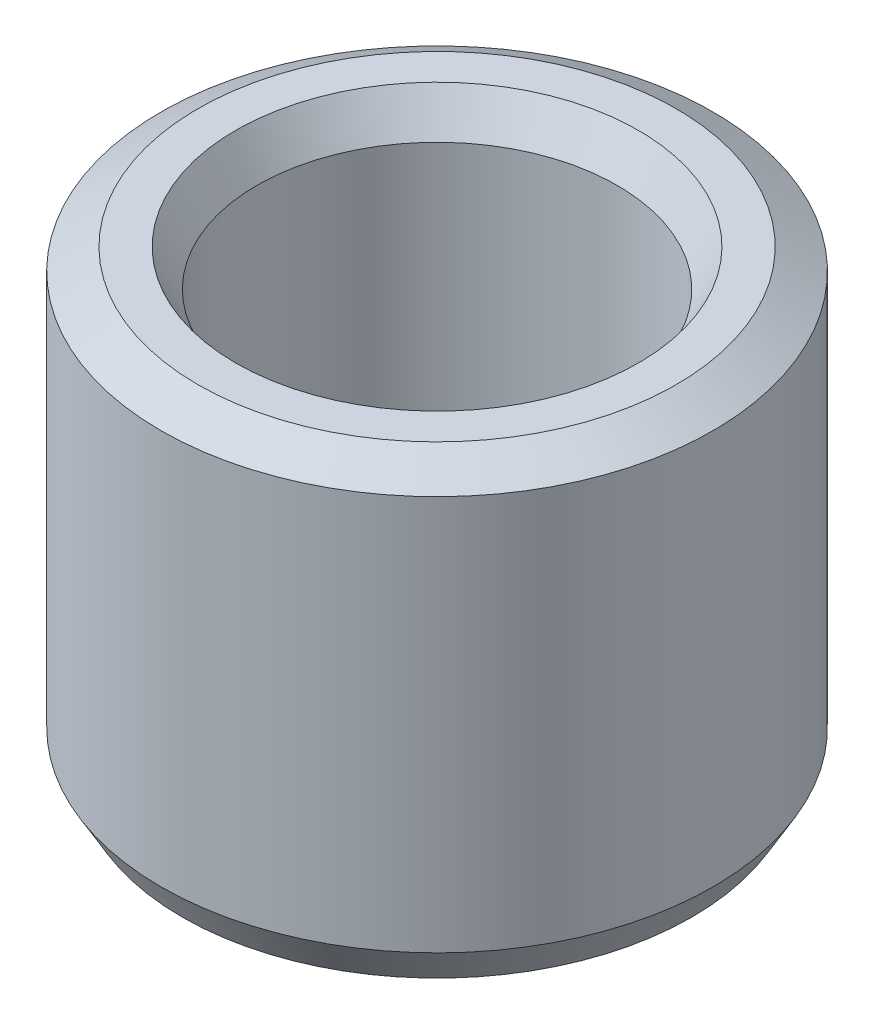
ISO-10303-21;
HEADER;
FILE_DESCRIPTION(('STEP AP214'),'2;1');
FILE_NAME('part.step','',(''),(''),'','','');
FILE_SCHEMA(('AUTOMOTIVE_DESIGN { 1 0 10303 214 1 1 1 1 }'));
ENDSEC;
DATA;
#1=APPLICATION_CONTEXT('core data for automotive mechanical design processes');
#2=APPLICATION_PROTOCOL_DEFINITION('international standard','automotive_design',2000,#1);
#3=PRODUCT_CONTEXT('',#1,'mechanical');
#4=PRODUCT('Part','Part','',(#3));
#5=PRODUCT_RELATED_PRODUCT_CATEGORY('part','',(#4));
#6=PRODUCT_DEFINITION_FORMATION('','',#4);
#7=PRODUCT_DEFINITION_CONTEXT('part definition',#1,'design');
#8=PRODUCT_DEFINITION('design','',#6,#7);
#9=PRODUCT_DEFINITION_SHAPE('','',#8);
#10=(LENGTH_UNIT() NAMED_UNIT(*) SI_UNIT(.MILLI.,.METRE.));
#11=(NAMED_UNIT(*) PLANE_ANGLE_UNIT() SI_UNIT($,.RADIAN.));
#12=(NAMED_UNIT(*) SI_UNIT($,.STERADIAN.) SOLID_ANGLE_UNIT());
#13=UNCERTAINTY_MEASURE_WITH_UNIT(LENGTH_MEASURE(1.E-05),#10,'distance_accuracy_value','');
#14=(GEOMETRIC_REPRESENTATION_CONTEXT(3) GLOBAL_UNCERTAINTY_ASSIGNED_CONTEXT((#13)) GLOBAL_UNIT_ASSIGNED_CONTEXT((#10,
#11,#12)) REPRESENTATION_CONTEXT('',''));
#15=CARTESIAN_POINT('',(0.,0.,0.));
#16=DIRECTION('',(0.,0.,1.));
#17=DIRECTION('',(1.,0.,0.));
#18=AXIS2_PLACEMENT_3D('',#15,#16,#17);
#19=CARTESIAN_POINT('',(0.,78.0125997931083,0.));
#20=DIRECTION('',(0.,-1.,0.));
#21=DIRECTION('',(0.,0.,-1.));
#22=AXIS2_PLACEMENT_3D('',#19,#20,#21);
#23=CYLINDRICAL_SURFACE('',#22,47.5);
#24=CARTESIAN_POINT('',(0.,6.35694811620943,0.));
#25=DIRECTION('',(0.,1.,0.));
#26=DIRECTION('',(0.,0.,1.));
#27=AXIS2_PLACEMENT_3D('',#24,#25,#26);
#28=CIRCLE('',#27,47.5);
#29=CARTESIAN_POINT('',(0.,6.35694811620943,47.5));
#30=VERTEX_POINT('',#29);
#31=EDGE_CURVE('E10',#30,#30,#28,.T.);
#32=ORIENTED_EDGE('',*,*,#31,.T.);
#33=EDGE_LOOP('',(#32));
#34=FACE_BOUND('',#33,.T.);
#35=CARTESIAN_POINT('',(0.,74.3424140869902,0.));
#36=DIRECTION('',(0.,1.,0.));
#37=DIRECTION('',(0.,0.,1.));
#38=AXIS2_PLACEMENT_3D('',#35,#36,#37);
#39=CIRCLE('',#38,47.5);
#40=CARTESIAN_POINT('',(0.,74.3424140869902,47.5));
#41=VERTEX_POINT('',#40);
#42=EDGE_CURVE('E50',#41,#41,#39,.F.);
#43=ORIENTED_EDGE('',*,*,#42,.T.);
#44=EDGE_LOOP('',(#43));
#45=FACE_BOUND('',#44,.T.);
#46=ADVANCED_FACE('F39',(#34,#45),#23,.T.);
#47=CARTESIAN_POINT('',(0.,78.0125997931083,0.));
#48=DIRECTION('',(0.,1.,0.));
#49=DIRECTION('',(0.,0.,1.));
#50=AXIS2_PLACEMENT_3D('',#47,#48,#49);
#51=PLANE('',#50);
#52=CARTESIAN_POINT('',(0.,78.0125997931083,0.));
#53=DIRECTION('',(0.,1.,0.));
#54=DIRECTION('',(0.,0.,1.));
#55=AXIS2_PLACEMENT_3D('',#52,#53,#54);
#56=CIRCLE('',#55,34.6663554390578);
#57=CARTESIAN_POINT('',(0.,78.0125997931083,34.6663554390578));
#58=VERTEX_POINT('',#57);
#59=EDGE_CURVE('E58',#58,#58,#56,.F.);
#60=ORIENTED_EDGE('',*,*,#59,.T.);
#61=EDGE_LOOP('',(#60));
#62=FACE_BOUND('',#61,.T.);
#63=CARTESIAN_POINT('',(0.,78.0125997931083,0.));
#64=DIRECTION('',(0.,1.,0.));
#65=DIRECTION('',(0.,0.,1.));
#66=AXIS2_PLACEMENT_3D('',#63,#64,#65);
#67=CIRCLE('',#66,41.1430518837905);
#68=CARTESIAN_POINT('',(0.,78.0125997931083,41.1430518837905));
#69=VERTEX_POINT('',#68);
#70=EDGE_CURVE('E61',#69,#69,#67,.T.);
#71=ORIENTED_EDGE('',*,*,#70,.T.);
#72=EDGE_LOOP('',(#71));
#73=FACE_BOUND('',#72,.T.);
#74=ADVANCED_FACE('F88',(#62,#73),#51,.T.);
#75=CARTESIAN_POINT('',(0.,0.,0.));
#76=DIRECTION('',(0.,1.,0.));
#77=DIRECTION('',(0.,0.,1.));
#78=AXIS2_PLACEMENT_3D('',#75,#76,#77);
#79=PLANE('',#78);
#80=CARTESIAN_POINT('',(0.,0.,0.));
#81=DIRECTION('',(0.,1.,0.));
#82=DIRECTION('',(0.,0.,1.));
#83=AXIS2_PLACEMENT_3D('',#80,#81,#82);
#84=CIRCLE('',#83,37.3531178491492);
#85=CARTESIAN_POINT('',(0.,0.,37.3531178491492));
#86=VERTEX_POINT('',#85);
#87=EDGE_CURVE('E51',#86,#86,#84,.T.);
#88=ORIENTED_EDGE('',*,*,#87,.T.);
#89=EDGE_LOOP('',(#88));
#90=FACE_BOUND('',#89,.T.);
#91=CARTESIAN_POINT('',(0.,0.,0.));
#92=DIRECTION('',(0.,1.,0.));
#93=DIRECTION('',(0.,0.,1.));
#94=AXIS2_PLACEMENT_3D('',#91,#92,#93);
#95=CIRCLE('',#94,43.829814293882);
#96=CARTESIAN_POINT('',(0.,0.,43.829814293882));
#97=VERTEX_POINT('',#96);
#98=EDGE_CURVE('E54',#97,#97,#95,.F.);
#99=ORIENTED_EDGE('',*,*,#98,.T.);
#100=EDGE_LOOP('',(#99));
#101=FACE_BOUND('',#100,.T.);
#102=ADVANCED_FACE('F83',(#90,#101),#79,.F.);
#103=CARTESIAN_POINT('',(0.,78.0125997931083,0.));
#104=DIRECTION('',(0.,-1.,0.));
#105=DIRECTION('',(0.,0.,-1.));
#106=AXIS2_PLACEMENT_3D('',#103,#104,#105);
#107=CYLINDRICAL_SURFACE('',#106,30.9961697329398);
#108=CARTESIAN_POINT('',(0.,71.6556516768988,0.));
#109=DIRECTION('',(0.,1.,0.));
#110=DIRECTION('',(0.,0.,1.));
#111=AXIS2_PLACEMENT_3D('',#108,#109,#110);
#112=CIRCLE('',#111,30.9961697329398);
#113=CARTESIAN_POINT('',(0.,71.6556516768988,30.9961697329398));
#114=VERTEX_POINT('',#113);
#115=EDGE_CURVE('E67',#114,#114,#112,.T.);
#116=ORIENTED_EDGE('',*,*,#115,.T.);
#117=EDGE_LOOP('',(#116));
#118=FACE_BOUND('',#117,.T.);
#119=CARTESIAN_POINT('',(0.,3.67018570611806,0.));
#120=DIRECTION('',(0.,1.,0.));
#121=DIRECTION('',(0.,0.,1.));
#122=AXIS2_PLACEMENT_3D('',#119,#120,#121);
#123=CIRCLE('',#122,30.9961697329398);
#124=CARTESIAN_POINT('',(0.,3.67018570611806,30.9961697329398));
#125=VERTEX_POINT('',#124);
#126=EDGE_CURVE('E69',#125,#125,#123,.F.);
#127=ORIENTED_EDGE('',*,*,#126,.T.);
#128=EDGE_LOOP('',(#127));
#129=FACE_BOUND('',#128,.T.);
#130=ADVANCED_FACE('F71',(#118,#129),#107,.F.);
#131=CARTESIAN_POINT('',(0.,71.6556516768988,0.));
#132=DIRECTION('',(0.,1.,0.));
#133=DIRECTION('',(0.,0.,1.));
#134=AXIS2_PLACEMENT_3D('',#131,#132,#133);
#135=CONICAL_SURFACE('',#134,30.9961697329398,0.523598775598303);
#136=CARTESIAN_POINT('',(0.,78.0125997931083,34.6663554390578));
#137=CARTESIAN_POINT('',(0.,77.9463815835644,34.6281243379524));
#138=CARTESIAN_POINT('',(0.,77.8801633740205,34.5898932368471));
#139=CARTESIAN_POINT('',(0.,77.7477269549328,34.5134310346363));
#140=CARTESIAN_POINT('',(0.,77.681508745389,34.4751999335309));
#141=CARTESIAN_POINT('',(0.,77.5490723263013,34.3987377313201));
#142=CARTESIAN_POINT('',(0.,77.4828541167575,34.3605066302147));
#143=CARTESIAN_POINT('',(0.,77.3504176976698,34.2840444280039));
#144=CARTESIAN_POINT('',(0.,77.2841994881259,34.2458133268985));
#145=CARTESIAN_POINT('',(0.,77.1517630690382,34.1693511246877));
#146=CARTESIAN_POINT('',(0.,77.0855448594944,34.1311200235823));
#147=CARTESIAN_POINT('',(0.,76.9531084404067,34.0546578213715));
#148=CARTESIAN_POINT('',(0.,76.8868902308628,34.0164267202661));
#149=CARTESIAN_POINT('',(0.,76.7544538117751,33.9399645180553));
#150=CARTESIAN_POINT('',(0.,76.6882356022313,33.9017334169499));
#151=CARTESIAN_POINT('',(0.,76.5557991831436,33.8252712147391));
#152=CARTESIAN_POINT('',(0.,76.4895809735997,33.7870401136337));
#153=CARTESIAN_POINT('',(0.,76.357144554512,33.7105779114229));
#154=CARTESIAN_POINT('',(0.,76.2909263449682,33.6723468103175));
#155=CARTESIAN_POINT('',(0.,76.1584899258805,33.5958846081067));
#156=CARTESIAN_POINT('',(0.,76.0922717163366,33.5576535070013));
#157=CARTESIAN_POINT('',(0.,75.9598352972489,33.4811913047905));
#158=CARTESIAN_POINT('',(0.,75.8936170877051,33.4429602036851));
#159=CARTESIAN_POINT('',(0.,75.7611806686174,33.3664980014744));
#160=CARTESIAN_POINT('',(0.,75.6949624590735,33.328266900369));
#161=CARTESIAN_POINT('',(0.,75.5625260399858,33.2518046981582));
#162=CARTESIAN_POINT('',(0.,75.496307830442,33.2135735970528));
#163=CARTESIAN_POINT('',(0.,75.3638714113543,33.137111394842));
#164=CARTESIAN_POINT('',(0.,75.2976532018104,33.0988802937366));
#165=CARTESIAN_POINT('',(0.,75.1652167827227,33.0224180915258));
#166=CARTESIAN_POINT('',(0.,75.0989985731789,32.9841869904204));
#167=CARTESIAN_POINT('',(0.,74.9665621540912,32.9077247882096));
#168=CARTESIAN_POINT('',(0.,74.9003439445473,32.8694936871042));
#169=CARTESIAN_POINT('',(0.,74.7679075254597,32.7930314848934));
#170=CARTESIAN_POINT('',(0.,74.7016893159158,32.754800383788));
#171=CARTESIAN_POINT('',(0.,74.5692528968281,32.6783381815772));
#172=CARTESIAN_POINT('',(0.,74.5030346872843,32.6401070804718));
#173=CARTESIAN_POINT('',(0.,74.3705982681966,32.563644878261));
#174=CARTESIAN_POINT('',(0.,74.3043800586527,32.5254137771556));
#175=CARTESIAN_POINT('',(0.,74.171943639565,32.4489515749448));
#176=CARTESIAN_POINT('',(0.,74.1057254300212,32.4107204738394));
#177=CARTESIAN_POINT('',(0.,73.9732890109335,32.3342582716286));
#178=CARTESIAN_POINT('',(0.,73.9070708013896,32.2960271705232));
#179=CARTESIAN_POINT('',(0.,73.7746343823019,32.2195649683125));
#180=CARTESIAN_POINT('',(0.,73.7084161727581,32.1813338672071));
#181=CARTESIAN_POINT('',(0.,73.5759797536704,32.1048716649963));
#182=CARTESIAN_POINT('',(0.,73.5097615441265,32.0666405638909));
#183=CARTESIAN_POINT('',(0.,73.3773251250388,31.9901783616801));
#184=CARTESIAN_POINT('',(0.,73.311106915495,31.9519472605747));
#185=CARTESIAN_POINT('',(0.,73.1786704964073,31.8754850583639));
#186=CARTESIAN_POINT('',(0.,73.1124522868634,31.8372539572585));
#187=CARTESIAN_POINT('',(0.,72.9800158677757,31.7607917550477));
#188=CARTESIAN_POINT('',(0.,72.9137976582319,31.7225606539423));
#189=CARTESIAN_POINT('',(0.,72.7813612391442,31.6460984517315));
#190=CARTESIAN_POINT('',(0.,72.7151430296003,31.6078673506261));
#191=CARTESIAN_POINT('',(0.,72.5827066105126,31.5314051484153));
#192=CARTESIAN_POINT('',(0.,72.5164884009688,31.4931740473099));
#193=CARTESIAN_POINT('',(0.,72.3840519818811,31.4167118450991));
#194=CARTESIAN_POINT('',(0.,72.3178337723372,31.3784807439937));
#195=CARTESIAN_POINT('',(0.,72.1853973532495,31.3020185417829));
#196=CARTESIAN_POINT('',(0.,72.1191791437057,31.2637874406775));
#197=CARTESIAN_POINT('',(0.,71.986742724618,31.1873252384667));
#198=CARTESIAN_POINT('',(0.,71.9205245150741,31.1490941373614));
#199=CARTESIAN_POINT('',(0.,71.7880880959865,31.0726319351506));
#200=CARTESIAN_POINT('',(0.,71.7218698864426,31.0344008340452));
#201=CARTESIAN_POINT('',(0.,71.6556516768988,30.9961697329398));
#202=B_SPLINE_CURVE_WITH_KNOTS('',3,(#136,#137,#138,#139,#140,#141,#142,#143,#144,#145,#146,
#147,#148,#149,#150,#151,#152,#153,#154,#155,#156,#157,#158,#159,#160,#161,#162,#163,#164,#165,
#166,#167,#168,#169,#170,#171,#172,#173,#174,#175,#176,#177,#178,#179,#180,#181,#182,#183,#184,
#185,#186,#187,#188,#189,#190,#191,#192,#193,#194,#195,#196,#197,#198,#199,#200,#201),
.UNSPECIFIED.,.F.,.F.,(4,2,2,2,2,2,2,2,2,2,2,2,2,2,2,2,2,2,2,2,2,2,2,2,2,2,2,2,2,2,2,2,4),(0.,
0.229386606632386,0.458773213264761,0.688159819897135,0.917546426529521,1.1469330331619,
1.37631963979427,1.60570624642666,1.83509285305903,2.0644794596914,2.29386606632379,
2.52325267295616,2.75263927958854,2.98202588622092,3.21141249285329,3.44079909948567,
3.67018570611804,3.89957231275043,4.1289589193828,4.35834552601518,4.58773213264756,
4.81711873927994,5.04650534591231,5.2758919525447,5.50527855917707,5.73466516580944,
5.96405177244183,6.19343837907421,6.42282498570658,6.65221159233896,6.88159819897134,
7.11098480560371,7.34037141223609),.UNSPECIFIED.);
#203=EDGE_CURVE('BSEAM77',#58,#114,#202,.T.);
#204=ORIENTED_EDGE('',*,*,#59,.F.);
#205=ORIENTED_EDGE('',*,*,#115,.F.);
#206=ORIENTED_EDGE('',*,*,#203,.T.);
#207=ORIENTED_EDGE('',*,*,#203,.F.);
#208=EDGE_LOOP('',(#204,#206,#205,#207));
#209=FACE_BOUND('',#208,.T.);
#210=ADVANCED_FACE('F77',(#209),#135,.F.);
#211=CARTESIAN_POINT('',(0.,0.,0.));
#212=DIRECTION('',(0.,-1.,0.));
#213=DIRECTION('',(0.,0.,-1.));
#214=AXIS2_PLACEMENT_3D('',#211,#212,#213);
#215=CONICAL_SURFACE('',#214,37.3531178491492,1.04719755119659);
#216=ORIENTED_EDGE('',*,*,#126,.F.);
#217=EDGE_LOOP('',(#216));
#218=FACE_BOUND('',#217,.T.);
#219=ORIENTED_EDGE('',*,*,#87,.F.);
#220=EDGE_LOOP('',(#219));
#221=FACE_BOUND('',#220,.T.);
#222=ADVANCED_FACE('F73',(#218,#221),#215,.F.);
#223=CARTESIAN_POINT('',(0.,6.35694811620943,0.));
#224=DIRECTION('',(0.,1.,0.));
#225=DIRECTION('',(0.,0.,1.));
#226=AXIS2_PLACEMENT_3D('',#223,#224,#225);
#227=CONICAL_SURFACE('',#226,47.5,0.523598775598303);
#228=ORIENTED_EDGE('',*,*,#98,.F.);
#229=EDGE_LOOP('',(#228));
#230=FACE_BOUND('',#229,.T.);
#231=ORIENTED_EDGE('',*,*,#31,.F.);
#232=EDGE_LOOP('',(#231));
#233=FACE_BOUND('',#232,.T.);
#234=ADVANCED_FACE('F76',(#230,#233),#227,.T.);
#235=CARTESIAN_POINT('',(0.,78.0125997931083,0.));
#236=DIRECTION('',(0.,-1.,0.));
#237=DIRECTION('',(0.,0.,-1.));
#238=AXIS2_PLACEMENT_3D('',#235,#236,#237);
#239=CONICAL_SURFACE('',#238,41.1430518837905,1.04719755119659);
#240=ORIENTED_EDGE('',*,*,#42,.F.);
#241=EDGE_LOOP('',(#240));
#242=FACE_BOUND('',#241,.T.);
#243=ORIENTED_EDGE('',*,*,#70,.F.);
#244=EDGE_LOOP('',(#243));
#245=FACE_BOUND('',#244,.T.);
#246=ADVANCED_FACE('F45',(#242,#245),#239,.T.);
#247=CLOSED_SHELL('',(#46,#74,#102,#130,#210,#222,#234,#246));
#248=MANIFOLD_SOLID_BREP('B2',#247);
#249=ADVANCED_BREP_SHAPE_REPRESENTATION('',(#18,#248),#14);
#250=SHAPE_DEFINITION_REPRESENTATION(#9,#249);
ENDSEC;
END-ISO-10303-21;
